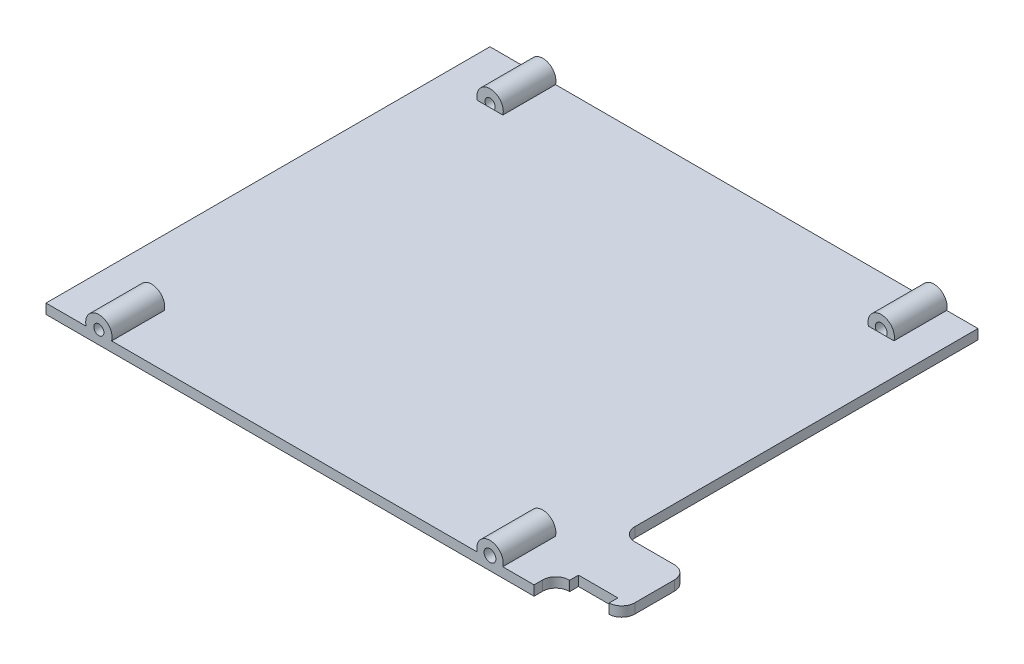
ISO-10303-21;
HEADER;
FILE_DESCRIPTION(('STEP AP214'),'2;1');
FILE_NAME('part.step','',(''),(''),'','','');
FILE_SCHEMA(('AUTOMOTIVE_DESIGN { 1 0 10303 214 1 1 1 1 }'));
ENDSEC;
DATA;
#1=APPLICATION_CONTEXT('core data for automotive mechanical design processes');
#2=APPLICATION_PROTOCOL_DEFINITION('international standard','automotive_design',2000,#1);
#3=PRODUCT_CONTEXT('',#1,'mechanical');
#4=PRODUCT('Part','Part','',(#3));
#5=PRODUCT_RELATED_PRODUCT_CATEGORY('part','',(#4));
#6=PRODUCT_DEFINITION_FORMATION('','',#4);
#7=PRODUCT_DEFINITION_CONTEXT('part definition',#1,'design');
#8=PRODUCT_DEFINITION('design','',#6,#7);
#9=PRODUCT_DEFINITION_SHAPE('','',#8);
#10=(LENGTH_UNIT() NAMED_UNIT(*) SI_UNIT(.MILLI.,.METRE.));
#11=(NAMED_UNIT(*) PLANE_ANGLE_UNIT() SI_UNIT($,.RADIAN.));
#12=(NAMED_UNIT(*) SI_UNIT($,.STERADIAN.) SOLID_ANGLE_UNIT());
#13=UNCERTAINTY_MEASURE_WITH_UNIT(LENGTH_MEASURE(1.E-05),#10,'distance_accuracy_value','');
#14=(GEOMETRIC_REPRESENTATION_CONTEXT(3) GLOBAL_UNCERTAINTY_ASSIGNED_CONTEXT((#13)) GLOBAL_UNIT_ASSIGNED_CONTEXT((#10,
#11,#12)) REPRESENTATION_CONTEXT('',''));
#15=CARTESIAN_POINT('',(0.,0.,0.));
#16=DIRECTION('',(0.,0.,1.));
#17=DIRECTION('',(1.,0.,0.));
#18=AXIS2_PLACEMENT_3D('',#15,#16,#17);
#19=CARTESIAN_POINT('',(-85.5905303741347,-18.8675075749451,141.472563016622));
#20=DIRECTION('',(-1.,0.,0.));
#21=DIRECTION('',(0.,-1.,0.));
#22=AXIS2_PLACEMENT_3D('',#19,#20,#21);
#23=PLANE('',#22);
#24=DIRECTION('',(0.,0.999999944421007,-0.000333403635094687));
#25=VECTOR('',#24,1.);
#26=CARTESIAN_POINT('',(-85.5905303741347,-20.3675075749451,52.0805001054825));
#27=LINE('',#26,#25);
#28=CARTESIAN_POINT('',(-85.5905303741347,-20.3675075749451,52.0805001054825));
#29=VERTEX_POINT('',#28);
#30=CARTESIAN_POINT('',(-85.5905303741347,-18.8675075749451,52.080000000002));
#31=VERTEX_POINT('',#30);
#32=EDGE_CURVE('E249',#29,#31,#27,.T.);
#33=ORIENTED_EDGE('',*,*,#32,.F.);
#34=DIRECTION('',(0.,0.,-1.));
#35=VECTOR('',#34,1.);
#36=CARTESIAN_POINT('',(-85.5905303741347,-20.3675075749451,141.472563016622));
#37=LINE('',#36,#35);
#38=CARTESIAN_POINT('',(-85.5905303741347,-20.3675075749451,0.));
#39=VERTEX_POINT('',#38);
#40=EDGE_CURVE('E398',#29,#39,#37,.T.);
#41=ORIENTED_EDGE('',*,*,#40,.T.);
#42=DIRECTION('',(0.,1.,0.));
#43=VECTOR('',#42,1.);
#44=CARTESIAN_POINT('',(-85.5905303741347,-18.8675075749451,0.));
#45=LINE('',#44,#43);
#46=CARTESIAN_POINT('',(-85.5905303741347,-18.8675075749451,0.));
#47=VERTEX_POINT('',#46);
#48=EDGE_CURVE('E390',#39,#47,#45,.T.);
#49=ORIENTED_EDGE('',*,*,#48,.T.);
#50=DIRECTION('',(0.,0.,-1.));
#51=VECTOR('',#50,1.);
#52=CARTESIAN_POINT('',(-85.5905303741347,-18.8675075749451,141.472563016622));
#53=LINE('',#52,#51);
#54=EDGE_CURVE('E393',#31,#47,#53,.T.);
#55=ORIENTED_EDGE('',*,*,#54,.F.);
#56=EDGE_LOOP('',(#33,#41,#49,#55));
#57=FACE_BOUND('',#56,.T.);
#58=ADVANCED_FACE('F39',(#57),#23,.F.);
#59=CARTESIAN_POINT('',(-159.667908124511,-18.8675075749451,141.472563016622));
#60=DIRECTION('',(0.,-1.,0.));
#61=DIRECTION('',(1.,0.,0.));
#62=AXIS2_PLACEMENT_3D('',#59,#60,#61);
#63=PLANE('',#62);
#64=DIRECTION('',(1.,0.,0.));
#65=VECTOR('',#64,1.);
#66=CARTESIAN_POINT('',(-159.667908124511,-18.8675075749451,62.7311529803631));
#67=LINE('',#66,#65);
#68=CARTESIAN_POINT('',(-83.4954652130825,-18.8675075749451,62.7311529803631));
#69=VERTEX_POINT('',#68);
#70=CARTESIAN_POINT('',(-77.5092926086521,-18.8675075749451,62.7311529803631));
#71=VERTEX_POINT('',#70);
#72=EDGE_CURVE('E224',#69,#71,#67,.T.);
#73=ORIENTED_EDGE('',*,*,#72,.T.);
#74=DIRECTION('',(0.,0.,1.));
#75=VECTOR('',#74,1.);
#76=CARTESIAN_POINT('',(-77.5092926086521,-18.8675075749451,141.472563016622));
#77=LINE('',#76,#75);
#78=CARTESIAN_POINT('',(-77.5092926086521,-18.8675075749449,64.0783494252668));
#79=VERTEX_POINT('',#78);
#80=EDGE_CURVE('E242',#71,#79,#77,.T.);
#81=ORIENTED_EDGE('',*,*,#80,.T.);
#82=CARTESIAN_POINT('',(-77.5905303741347,-18.867507574945,62.0800000000012));
#83=DIRECTION('',(0.,-1.,0.));
#84=DIRECTION('',(1.,0.,0.));
#85=AXIS2_PLACEMENT_3D('',#82,#83,#84);
#86=CIRCLE('',#85,2.);
#87=CARTESIAN_POINT('',(-75.5905303741347,-18.867507574945,62.0800000000012));
#88=VERTEX_POINT('',#87);
#89=EDGE_CURVE('E261',#88,#79,#86,.T.);
#90=ORIENTED_EDGE('',*,*,#89,.F.);
#91=DIRECTION('',(0.,0.,1.));
#92=VECTOR('',#91,1.);
#93=CARTESIAN_POINT('',(-75.5905303741347,-18.867507574945,52.080000000002));
#94=LINE('',#93,#92);
#95=CARTESIAN_POINT('',(-75.5905303741347,-18.867507574945,56.0800000000021));
#96=VERTEX_POINT('',#95);
#97=EDGE_CURVE('E258',#96,#88,#94,.T.);
#98=ORIENTED_EDGE('',*,*,#97,.F.);
#99=CARTESIAN_POINT('',(-77.5905303741347,-18.867507574945,56.0800000000021));
#100=DIRECTION('',(0.,-1.,0.));
#101=DIRECTION('',(1.,0.,0.));
#102=AXIS2_PLACEMENT_3D('',#99,#100,#101);
#103=CIRCLE('',#102,2.);
#104=CARTESIAN_POINT('',(-77.5905303741347,-18.867507574945,54.0800000000021));
#105=VERTEX_POINT('',#104);
#106=EDGE_CURVE('E255',#105,#96,#103,.T.);
#107=ORIENTED_EDGE('',*,*,#106,.F.);
#108=DIRECTION('',(1.,0.,0.));
#109=VECTOR('',#108,1.);
#110=CARTESIAN_POINT('',(-33.1479999999989,-18.8675075749446,54.0800000000021));
#111=LINE('',#110,#109);
#112=CARTESIAN_POINT('',(-83.5905303741347,-18.8675075749451,54.0800000000021));
#113=VERTEX_POINT('',#112);
#114=EDGE_CURVE('E253',#113,#105,#111,.T.);
#115=ORIENTED_EDGE('',*,*,#114,.F.);
#116=CARTESIAN_POINT('',(-83.5905303741347,-18.8675075749451,52.0800000000021));
#117=DIRECTION('',(0.,-1.,0.));
#118=DIRECTION('',(1.,0.,0.));
#119=AXIS2_PLACEMENT_3D('',#116,#117,#118);
#120=CIRCLE('',#119,2.);
#121=EDGE_CURVE('E62',#113,#31,#120,.T.);
#122=ORIENTED_EDGE('',*,*,#121,.T.);
#123=ORIENTED_EDGE('',*,*,#54,.T.);
#124=DIRECTION('',(-1.,0.,0.));
#125=VECTOR('',#124,1.);
#126=CARTESIAN_POINT('',(-159.667908124511,-18.8675075749451,0.));
#127=LINE('',#126,#125);
#128=CARTESIAN_POINT('',(-90.3438704257039,-18.8675075749451,0.));
#129=VERTEX_POINT('',#128);
#130=EDGE_CURVE('E386',#47,#129,#127,.T.);
#131=ORIENTED_EDGE('',*,*,#130,.T.);
#132=DIRECTION('',(0.,0.,-1.));
#133=VECTOR('',#132,1.);
#134=CARTESIAN_POINT('',(-90.3438704257039,-18.8675075749451,8.));
#135=LINE('',#134,#133);
#136=CARTESIAN_POINT('',(-90.3438704257039,-18.8675075749451,8.));
#137=VERTEX_POINT('',#136);
#138=EDGE_CURVE('E360',#137,#129,#135,.T.);
#139=ORIENTED_EDGE('',*,*,#138,.F.);
#140=DIRECTION('',(-1.,0.,0.));
#141=VECTOR('',#140,1.);
#142=CARTESIAN_POINT('',(-159.667908124511,-18.8675075749451,8.00000000000001));
#143=LINE('',#142,#141);
#144=CARTESIAN_POINT('',(-91.5320306214526,-18.8675075749451,8.));
#145=VERTEX_POINT('',#144);
#146=EDGE_CURVE('E420',#137,#145,#143,.T.);
#147=ORIENTED_EDGE('',*,*,#146,.T.);
#148=CARTESIAN_POINT('',(-93.0286935761624,-18.8675075749451,8.));
#149=VERTEX_POINT('',#148);
#150=EDGE_CURVE('E424',#145,#149,#143,.T.);
#151=ORIENTED_EDGE('',*,*,#150,.T.);
#152=CARTESIAN_POINT('',(-94.2168537719112,-18.8675075749451,8.));
#153=VERTEX_POINT('',#152);
#154=EDGE_CURVE('E402',#149,#153,#143,.T.);
#155=ORIENTED_EDGE('',*,*,#154,.T.);
#156=DIRECTION('',(0.,0.,-1.));
#157=VECTOR('',#156,1.);
#158=CARTESIAN_POINT('',(-94.2168537719112,-18.8675075749451,8.));
#159=LINE('',#158,#157);
#160=CARTESIAN_POINT('',(-94.2168537719112,-18.8675075749451,0.));
#161=VERTEX_POINT('',#160);
#162=EDGE_CURVE('E371',#161,#153,#159,.F.);
#163=ORIENTED_EDGE('',*,*,#162,.F.);
#164=CARTESIAN_POINT('',(-149.708016259504,-18.8675075749451,0.));
#165=VERTEX_POINT('',#164);
#166=EDGE_CURVE('E388',#161,#165,#127,.T.);
#167=ORIENTED_EDGE('',*,*,#166,.T.);
#168=DIRECTION('',(0.,0.,-1.));
#169=VECTOR('',#168,1.);
#170=CARTESIAN_POINT('',(-149.708016259504,-18.8675075749451,8.));
#171=LINE('',#170,#169);
#172=CARTESIAN_POINT('',(-149.708016259504,-18.8675075749451,8.));
#173=VERTEX_POINT('',#172);
#174=EDGE_CURVE('E374',#173,#165,#171,.T.);
#175=ORIENTED_EDGE('',*,*,#174,.F.);
#176=DIRECTION('',(-1.,0.,0.));
#177=VECTOR('',#176,1.);
#178=CARTESIAN_POINT('',(-159.667908124511,-18.8675075749451,8.00000000000001));
#179=LINE('',#178,#177);
#180=CARTESIAN_POINT('',(-151.059398233736,-18.8675075749451,8.));
#181=VERTEX_POINT('',#180);
#182=EDGE_CURVE('E425',#173,#181,#179,.T.);
#183=ORIENTED_EDGE('',*,*,#182,.T.);
#184=CARTESIAN_POINT('',(-152.22961763148,-18.8675075749451,8.));
#185=VERTEX_POINT('',#184);
#186=EDGE_CURVE('E429',#181,#185,#179,.T.);
#187=ORIENTED_EDGE('',*,*,#186,.T.);
#188=CARTESIAN_POINT('',(-153.580999605712,-18.8675075749451,8.));
#189=VERTEX_POINT('',#188);
#190=EDGE_CURVE('E423',#185,#189,#179,.T.);
#191=ORIENTED_EDGE('',*,*,#190,.T.);
#192=DIRECTION('',(0.,0.,-1.));
#193=VECTOR('',#192,1.);
#194=CARTESIAN_POINT('',(-153.580999605712,-18.8675075749451,8.));
#195=LINE('',#194,#193);
#196=CARTESIAN_POINT('',(-153.580999605712,-18.8675075749451,0.));
#197=VERTEX_POINT('',#196);
#198=EDGE_CURVE('E377',#197,#189,#195,.F.);
#199=ORIENTED_EDGE('',*,*,#198,.F.);
#200=CARTESIAN_POINT('',(-159.667908124511,-18.8675075749451,0.));
#201=VERTEX_POINT('',#200);
#202=EDGE_CURVE('E389',#197,#201,#127,.T.);
#203=ORIENTED_EDGE('',*,*,#202,.T.);
#204=DIRECTION('',(0.,0.,-1.));
#205=VECTOR('',#204,1.);
#206=CARTESIAN_POINT('',(-159.667908124511,-18.8675075749451,141.472563016622));
#207=LINE('',#206,#205);
#208=CARTESIAN_POINT('',(-159.667908124511,-18.8675075749451,67.3800000000011));
#209=VERTEX_POINT('',#208);
#210=EDGE_CURVE('E385',#209,#201,#207,.T.);
#211=ORIENTED_EDGE('',*,*,#210,.F.);
#212=DIRECTION('',(-1.,0.,0.));
#213=VECTOR('',#212,1.);
#214=CARTESIAN_POINT('',(-159.667908124511,-18.8675075749451,67.3800000000011));
#215=LINE('',#214,#213);
#216=CARTESIAN_POINT('',(-153.580999605713,-18.8675075749451,67.3800000000011));
#217=VERTEX_POINT('',#216);
#218=EDGE_CURVE('E404',#217,#209,#215,.T.);
#219=ORIENTED_EDGE('',*,*,#218,.F.);
#220=DIRECTION('',(0.,0.,1.));
#221=VECTOR('',#220,1.);
#222=CARTESIAN_POINT('',(-153.580999605713,-18.8675075749451,59.3800000000013));
#223=LINE('',#222,#221);
#224=CARTESIAN_POINT('',(-153.580999605713,-18.8675075749451,59.3800000000013));
#225=VERTEX_POINT('',#224);
#226=EDGE_CURVE('E328',#225,#217,#223,.T.);
#227=ORIENTED_EDGE('',*,*,#226,.F.);
#228=DIRECTION('',(1.,0.,0.));
#229=VECTOR('',#228,1.);
#230=CARTESIAN_POINT('',(-159.667908124511,-18.8675075749451,59.3800000000013));
#231=LINE('',#230,#229);
#232=CARTESIAN_POINT('',(-152.22961763148,-18.8675075749451,59.3800000000013));
#233=VERTEX_POINT('',#232);
#234=EDGE_CURVE('E340',#225,#233,#231,.T.);
#235=ORIENTED_EDGE('',*,*,#234,.T.);
#236=CARTESIAN_POINT('',(-151.059398233736,-18.8675075749451,59.3800000000013));
#237=VERTEX_POINT('',#236);
#238=EDGE_CURVE('E344',#233,#237,#231,.T.);
#239=ORIENTED_EDGE('',*,*,#238,.T.);
#240=CARTESIAN_POINT('',(-149.708016259504,-18.8675075749451,59.3800000000013));
#241=VERTEX_POINT('',#240);
#242=EDGE_CURVE('E338',#237,#241,#231,.T.);
#243=ORIENTED_EDGE('',*,*,#242,.T.);
#244=DIRECTION('',(0.,0.,1.));
#245=VECTOR('',#244,1.);
#246=CARTESIAN_POINT('',(-149.708016259504,-18.8675075749451,59.3800000000013));
#247=LINE('',#246,#245);
#248=CARTESIAN_POINT('',(-149.708016259504,-18.8675075749451,67.3800000000013));
#249=VERTEX_POINT('',#248);
#250=EDGE_CURVE('E331',#249,#241,#247,.F.);
#251=ORIENTED_EDGE('',*,*,#250,.F.);
#252=CARTESIAN_POINT('',(-94.216853771912,-18.8675075749451,67.3800000000012));
#253=VERTEX_POINT('',#252);
#254=EDGE_CURVE('E403',#253,#249,#215,.T.);
#255=ORIENTED_EDGE('',*,*,#254,.F.);
#256=DIRECTION('',(0.,0.,1.));
#257=VECTOR('',#256,1.);
#258=CARTESIAN_POINT('',(-94.216853771912,-18.8675075749451,59.3800000000013));
#259=LINE('',#258,#257);
#260=CARTESIAN_POINT('',(-94.216853771912,-18.8675075749451,59.3800000000013));
#261=VERTEX_POINT('',#260);
#262=EDGE_CURVE('E316',#261,#253,#259,.T.);
#263=ORIENTED_EDGE('',*,*,#262,.F.);
#264=DIRECTION('',(1.,0.,0.));
#265=VECTOR('',#264,1.);
#266=CARTESIAN_POINT('',(-159.667908124511,-18.8675075749451,59.3800000000013));
#267=LINE('',#266,#265);
#268=CARTESIAN_POINT('',(-93.028693576163,-18.8675075749451,59.3800000000013));
#269=VERTEX_POINT('',#268);
#270=EDGE_CURVE('E335',#261,#269,#267,.T.);
#271=ORIENTED_EDGE('',*,*,#270,.T.);
#272=CARTESIAN_POINT('',(-91.5320306214525,-18.8675075749451,59.3800000000013));
#273=VERTEX_POINT('',#272);
#274=EDGE_CURVE('E339',#269,#273,#267,.T.);
#275=ORIENTED_EDGE('',*,*,#274,.T.);
#276=CARTESIAN_POINT('',(-90.343870425704,-18.8675075749451,59.3800000000013));
#277=VERTEX_POINT('',#276);
#278=EDGE_CURVE('E334',#273,#277,#267,.T.);
#279=ORIENTED_EDGE('',*,*,#278,.T.);
#280=DIRECTION('',(0.,0.,1.));
#281=VECTOR('',#280,1.);
#282=CARTESIAN_POINT('',(-90.343870425704,-18.8675075749451,59.3800000000013));
#283=LINE('',#282,#281);
#284=CARTESIAN_POINT('',(-90.343870425704,-18.8675075749451,67.3800000000013));
#285=VERTEX_POINT('',#284);
#286=EDGE_CURVE('E325',#285,#277,#283,.F.);
#287=ORIENTED_EDGE('',*,*,#286,.F.);
#288=CARTESIAN_POINT('',(-85.5905303741347,-18.8675075749451,67.3800000000012));
#289=VERTEX_POINT('',#288);
#290=EDGE_CURVE('E399',#289,#285,#215,.T.);
#291=ORIENTED_EDGE('',*,*,#290,.F.);
#292=CARTESIAN_POINT('',(-85.5905303741347,-18.8675075749451,66.0800000000012));
#293=VERTEX_POINT('',#292);
#294=EDGE_CURVE('E414',#289,#293,#53,.T.);
#295=ORIENTED_EDGE('',*,*,#294,.T.);
#296=CARTESIAN_POINT('',(-83.5905303741347,-18.8675075749451,66.0800000000012));
#297=DIRECTION('',(0.,-1.,0.));
#298=DIRECTION('',(1.,0.,0.));
#299=AXIS2_PLACEMENT_3D('',#296,#297,#298);
#300=CIRCLE('',#299,2.);
#301=CARTESIAN_POINT('',(-83.5905303741347,-18.8675075749451,64.0800000000012));
#302=VERTEX_POINT('',#301);
#303=EDGE_CURVE('E270',#293,#302,#300,.T.);
#304=ORIENTED_EDGE('',*,*,#303,.T.);
#305=DIRECTION('',(-1.,0.,0.));
#306=VECTOR('',#305,1.);
#307=CARTESIAN_POINT('',(-33.147999999999,-18.8675075749446,64.0800000000013));
#308=LINE('',#307,#306);
#309=CARTESIAN_POINT('',(-83.4954652130825,-18.8675075749449,64.0800000000012));
#310=VERTEX_POINT('',#309);
#311=EDGE_CURVE('E264',#310,#302,#308,.T.);
#312=ORIENTED_EDGE('',*,*,#311,.F.);
#313=DIRECTION('',(0.,0.,-1.));
#314=VECTOR('',#313,1.);
#315=CARTESIAN_POINT('',(-83.4954652130825,-18.8675075749451,141.472563016622));
#316=LINE('',#315,#314);
#317=EDGE_CURVE('E246',#310,#69,#316,.T.);
#318=ORIENTED_EDGE('',*,*,#317,.T.);
#319=EDGE_LOOP('',(#73,#81,#90,#98,#107,#115,#122,#123,#131,#139,#147,#151,#155,#163,#167,#175,
#183,#187,#191,#199,#203,#211,#219,#227,#235,#239,#243,#251,#255,#263,#271,#275,#279,#287,#291,
#295,#304,#312,#318));
#320=FACE_BOUND('',#319,.T.);
#321=ADVANCED_FACE('F438',(#320),#63,.F.);
#322=CARTESIAN_POINT('',(-85.5905303741347,-20.3675075749451,141.472563016622));
#323=DIRECTION('',(0.,1.,0.));
#324=DIRECTION('',(-1.,0.,0.));
#325=AXIS2_PLACEMENT_3D('',#322,#323,#324);
#326=PLANE('',#325);
#327=CARTESIAN_POINT('',(-77.5905303741347,-20.3675075749451,62.0800000000012));
#328=DIRECTION('',(0.,1.,0.));
#329=DIRECTION('',(-1.,0.,0.));
#330=AXIS2_PLACEMENT_3D('',#327,#328,#329);
#331=CIRCLE('',#330,2.);
#332=CARTESIAN_POINT('',(-77.5092926086521,-20.3675075749451,64.0783494252668));
#333=VERTEX_POINT('',#332);
#334=CARTESIAN_POINT('',(-75.5905303741347,-20.3675075749451,62.0800000000012));
#335=VERTEX_POINT('',#334);
#336=EDGE_CURVE('E277',#333,#335,#331,.T.);
#337=ORIENTED_EDGE('',*,*,#336,.F.);
#338=DIRECTION('',(0.,0.,1.));
#339=VECTOR('',#338,1.);
#340=CARTESIAN_POINT('',(-77.5092926086521,-20.3675075749454,62.7311529803631));
#341=LINE('',#340,#339);
#342=CARTESIAN_POINT('',(-77.5092926086521,-20.3675075749454,62.7311529803631));
#343=VERTEX_POINT('',#342);
#344=EDGE_CURVE('E54',#343,#333,#341,.T.);
#345=ORIENTED_EDGE('',*,*,#344,.F.);
#346=DIRECTION('',(1.,0.,0.));
#347=VECTOR('',#346,1.);
#348=CARTESIAN_POINT('',(-83.4954652130825,-20.3675075749454,62.7311529803631));
#349=LINE('',#348,#347);
#350=CARTESIAN_POINT('',(-83.4954652130825,-20.3675075749454,62.7311529803631));
#351=VERTEX_POINT('',#350);
#352=EDGE_CURVE('E222',#351,#343,#349,.T.);
#353=ORIENTED_EDGE('',*,*,#352,.F.);
#354=DIRECTION('',(0.,0.,-1.));
#355=VECTOR('',#354,1.);
#356=CARTESIAN_POINT('',(-83.4954652130825,-20.3675075749454,66.6522392252637));
#357=LINE('',#356,#355);
#358=CARTESIAN_POINT('',(-83.4954652130825,-20.3675075749454,64.0800000000012));
#359=VERTEX_POINT('',#358);
#360=EDGE_CURVE('E230',#359,#351,#357,.T.);
#361=ORIENTED_EDGE('',*,*,#360,.F.);
#362=DIRECTION('',(1.,0.,0.));
#363=VECTOR('',#362,1.);
#364=CARTESIAN_POINT('',(-85.5905303741347,-20.3675075749451,64.080000000002));
#365=LINE('',#364,#363);
#366=CARTESIAN_POINT('',(-83.5905303741347,-20.3675075749451,64.080000000002));
#367=VERTEX_POINT('',#366);
#368=EDGE_CURVE('E275',#367,#359,#365,.T.);
#369=ORIENTED_EDGE('',*,*,#368,.F.);
#370=CARTESIAN_POINT('',(-83.5905303741347,-20.3675075749451,66.0800000000012));
#371=DIRECTION('',(0.,1.,0.));
#372=DIRECTION('',(-1.,0.,0.));
#373=AXIS2_PLACEMENT_3D('',#370,#371,#372);
#374=CIRCLE('',#373,2.);
#375=CARTESIAN_POINT('',(-85.5905303741347,-20.3675075749451,66.0800000000012));
#376=VERTEX_POINT('',#375);
#377=EDGE_CURVE('E273',#376,#367,#374,.F.);
#378=ORIENTED_EDGE('',*,*,#377,.F.);
#379=CARTESIAN_POINT('',(-85.5905303741347,-20.3675075749451,67.3800000000012));
#380=VERTEX_POINT('',#379);
#381=EDGE_CURVE('E394',#380,#376,#37,.T.);
#382=ORIENTED_EDGE('',*,*,#381,.F.);
#383=DIRECTION('',(1.,0.,0.));
#384=VECTOR('',#383,1.);
#385=CARTESIAN_POINT('',(-85.5905303741346,-20.3675075749451,67.3800000000012));
#386=LINE('',#385,#384);
#387=CARTESIAN_POINT('',(-159.667908124511,-20.3675075749451,67.3800000000011));
#388=VERTEX_POINT('',#387);
#389=EDGE_CURVE('E408',#388,#380,#386,.T.);
#390=ORIENTED_EDGE('',*,*,#389,.F.);
#391=DIRECTION('',(0.,0.,-1.));
#392=VECTOR('',#391,1.);
#393=CARTESIAN_POINT('',(-159.667908124511,-20.3675075749451,141.472563016622));
#394=LINE('',#393,#392);
#395=CARTESIAN_POINT('',(-159.667908124511,-20.3675075749451,0.));
#396=VERTEX_POINT('',#395);
#397=EDGE_CURVE('E380',#388,#396,#394,.T.);
#398=ORIENTED_EDGE('',*,*,#397,.T.);
#399=DIRECTION('',(1.,0.,0.));
#400=VECTOR('',#399,1.);
#401=CARTESIAN_POINT('',(-85.5905303741347,-20.3675075749451,0.));
#402=LINE('',#401,#400);
#403=EDGE_CURVE('E395',#396,#39,#402,.T.);
#404=ORIENTED_EDGE('',*,*,#403,.T.);
#405=ORIENTED_EDGE('',*,*,#40,.F.);
#406=CARTESIAN_POINT('',(-83.5905303741347,-20.3675075749451,52.0800000000021));
#407=DIRECTION('',(0.,1.,0.));
#408=DIRECTION('',(-1.,0.,0.));
#409=AXIS2_PLACEMENT_3D('',#406,#407,#408);
#410=CIRCLE('',#409,2.);
#411=CARTESIAN_POINT('',(-83.5905303741347,-20.3675075749451,54.0800000000021));
#412=VERTEX_POINT('',#411);
#413=EDGE_CURVE('E267',#29,#412,#410,.T.);
#414=ORIENTED_EDGE('',*,*,#413,.T.);
#415=DIRECTION('',(-1.,0.,0.));
#416=VECTOR('',#415,1.);
#417=CARTESIAN_POINT('',(-75.5905303741347,-20.3675075749451,54.0800000000021));
#418=LINE('',#417,#416);
#419=CARTESIAN_POINT('',(-77.5905303741347,-20.3675075749451,54.0800000000021));
#420=VERTEX_POINT('',#419);
#421=EDGE_CURVE('E269',#420,#412,#418,.T.);
#422=ORIENTED_EDGE('',*,*,#421,.F.);
#423=CARTESIAN_POINT('',(-77.5905303741347,-20.3675075749451,56.0800000000021));
#424=DIRECTION('',(0.,1.,0.));
#425=DIRECTION('',(-1.,0.,0.));
#426=AXIS2_PLACEMENT_3D('',#423,#424,#425);
#427=CIRCLE('',#426,2.);
#428=CARTESIAN_POINT('',(-75.5905303741347,-20.3675075749451,56.0800000000021));
#429=VERTEX_POINT('',#428);
#430=EDGE_CURVE('E266',#429,#420,#427,.T.);
#431=ORIENTED_EDGE('',*,*,#430,.F.);
#432=DIRECTION('',(0.,0.,-1.));
#433=VECTOR('',#432,1.);
#434=CARTESIAN_POINT('',(-75.5905303741347,-20.3675075749451,64.0800000000021));
#435=LINE('',#434,#433);
#436=EDGE_CURVE('E279',#335,#429,#435,.T.);
#437=ORIENTED_EDGE('',*,*,#436,.F.);
#438=EDGE_LOOP('',(#337,#345,#353,#361,#369,#378,#382,#390,#398,#404,#405,#414,#422,#431,#437));
#439=FACE_BOUND('',#438,.T.);
#440=ADVANCED_FACE('F238',(#439),#326,.F.);
#441=ORIENTED_EDGE('',*,*,#381,.T.);
#442=DIRECTION('',(0.,1.,0.));
#443=VECTOR('',#442,1.);
#444=CARTESIAN_POINT('',(-85.5905303741347,19.6324924250549,66.0800000000012));
#445=LINE('',#444,#443);
#446=EDGE_CURVE('E252',#293,#376,#445,.F.);
#447=ORIENTED_EDGE('',*,*,#446,.F.);
#448=ORIENTED_EDGE('',*,*,#294,.F.);
#449=DIRECTION('',(0.,1.,0.));
#450=VECTOR('',#449,1.);
#451=CARTESIAN_POINT('',(-85.5905303741347,-18.8675075749451,67.3800000000012));
#452=LINE('',#451,#450);
#453=EDGE_CURVE('E405',#380,#289,#452,.T.);
#454=ORIENTED_EDGE('',*,*,#453,.F.);
#455=EDGE_LOOP('',(#441,#447,#448,#454));
#456=FACE_BOUND('',#455,.T.);
#457=ADVANCED_FACE('F497',(#456),#23,.F.);
#458=CARTESIAN_POINT('',(-159.667908124511,-20.3675075749451,141.472563016622));
#459=DIRECTION('',(1.,0.,0.));
#460=DIRECTION('',(0.,0.,-1.));
#461=AXIS2_PLACEMENT_3D('',#458,#459,#460);
#462=PLANE('',#461);
#463=DIRECTION('',(0.,-1.,0.));
#464=VECTOR('',#463,1.);
#465=CARTESIAN_POINT('',(-159.667908124511,-20.3675075749451,67.3800000000011));
#466=LINE('',#465,#464);
#467=EDGE_CURVE('E384',#209,#388,#466,.T.);
#468=ORIENTED_EDGE('',*,*,#467,.F.);
#469=ORIENTED_EDGE('',*,*,#210,.T.);
#470=DIRECTION('',(0.,-1.,0.));
#471=VECTOR('',#470,1.);
#472=CARTESIAN_POINT('',(-159.667908124511,-20.3675075749451,0.));
#473=LINE('',#472,#471);
#474=EDGE_CURVE('E381',#201,#396,#473,.T.);
#475=ORIENTED_EDGE('',*,*,#474,.T.);
#476=ORIENTED_EDGE('',*,*,#397,.F.);
#477=EDGE_LOOP('',(#468,#469,#475,#476));
#478=FACE_BOUND('',#477,.T.);
#479=ADVANCED_FACE('F504',(#478),#462,.F.);
#480=CARTESIAN_POINT('',(0.,0.,0.));
#481=DIRECTION('',(0.,0.,-1.));
#482=DIRECTION('',(-1.,0.,0.));
#483=AXIS2_PLACEMENT_3D('',#480,#481,#482);
#484=PLANE('',#483);
#485=CARTESIAN_POINT('',(-151.644507932608,-18.3675075749456,0.));
#486=DIRECTION('',(0.,0.,-1.));
#487=DIRECTION('',(-1.,0.,0.));
#488=AXIS2_PLACEMENT_3D('',#485,#486,#487);
#489=CIRCLE('',#488,0.769644956920995);
#490=CARTESIAN_POINT('',(-152.414152889529,-18.3675075749456,0.));
#491=VERTEX_POINT('',#490);
#492=EDGE_CURVE('E345',#491,#491,#489,.T.);
#493=ORIENTED_EDGE('',*,*,#492,.F.);
#494=EDGE_LOOP('',(#493));
#495=FACE_BOUND('',#494,.T.);
#496=CARTESIAN_POINT('',(-92.2803620988075,-18.3675075749452,0.));
#497=DIRECTION('',(0.,0.,-1.));
#498=DIRECTION('',(-1.,0.,0.));
#499=AXIS2_PLACEMENT_3D('',#496,#497,#498);
#500=CIRCLE('',#499,0.900000000000003);
#501=CARTESIAN_POINT('',(-93.1803620988075,-18.3675075749452,0.));
#502=VERTEX_POINT('',#501);
#503=EDGE_CURVE('E349',#502,#502,#500,.T.);
#504=ORIENTED_EDGE('',*,*,#503,.F.);
#505=EDGE_LOOP('',(#504));
#506=FACE_BOUND('',#505,.T.);
#507=ORIENTED_EDGE('',*,*,#48,.F.);
#508=ORIENTED_EDGE('',*,*,#403,.F.);
#509=ORIENTED_EDGE('',*,*,#474,.F.);
#510=ORIENTED_EDGE('',*,*,#202,.F.);
#511=CARTESIAN_POINT('',(-151.644507932608,-18.3675075749453,0.));
#512=DIRECTION('',(0.,0.,1.));
#513=DIRECTION('',(1.,0.,0.));
#514=AXIS2_PLACEMENT_3D('',#511,#512,#513);
#515=CIRCLE('',#514,2.00000000000008);
#516=EDGE_CURVE('E361',#165,#197,#515,.T.);
#517=ORIENTED_EDGE('',*,*,#516,.F.);
#518=ORIENTED_EDGE('',*,*,#166,.F.);
#519=CARTESIAN_POINT('',(-92.2803620988075,-18.3675075749452,0.));
#520=DIRECTION('',(0.,0.,1.));
#521=DIRECTION('',(1.,0.,0.));
#522=AXIS2_PLACEMENT_3D('',#519,#520,#521);
#523=CIRCLE('',#522,1.99999999999992);
#524=EDGE_CURVE('E364',#129,#161,#523,.T.);
#525=ORIENTED_EDGE('',*,*,#524,.F.);
#526=ORIENTED_EDGE('',*,*,#130,.F.);
#527=EDGE_LOOP('',(#507,#508,#509,#510,#517,#518,#525,#526));
#528=FACE_BOUND('',#527,.T.);
#529=ADVANCED_FACE('F467',(#495,#506,#528),#484,.T.);
#530=CARTESIAN_POINT('',(-53.15,-0.367507574945569,67.3800000000013));
#531=DIRECTION('',(0.,0.,1.));
#532=DIRECTION('',(0.999885624174656,-0.0151241055556286,0.));
#533=AXIS2_PLACEMENT_3D('',#530,#531,#532);
#534=PLANE('',#533);
#535=CARTESIAN_POINT('',(-92.2803620988078,-18.3675075749455,67.3800000000013));
#536=DIRECTION('',(0.,0.,-1.));
#537=DIRECTION('',(0.,1.,0.));
#538=AXIS2_PLACEMENT_3D('',#535,#536,#537);
#539=CIRCLE('',#538,0.900000000000158);
#540=CARTESIAN_POINT('',(-92.2803620988078,-17.4675075749454,67.3800000000013));
#541=VERTEX_POINT('',#540);
#542=EDGE_CURVE('E303',#541,#541,#539,.T.);
#543=ORIENTED_EDGE('',*,*,#542,.T.);
#544=EDGE_LOOP('',(#543));
#545=FACE_BOUND('',#544,.T.);
#546=CARTESIAN_POINT('',(-151.644507932608,-18.3675075749455,67.3800000000013));
#547=DIRECTION('',(0.,0.,-1.));
#548=DIRECTION('',(0.,1.,0.));
#549=AXIS2_PLACEMENT_3D('',#546,#547,#548);
#550=CIRCLE('',#549,0.769644956920995);
#551=CARTESIAN_POINT('',(-151.644507932608,-17.5978626180245,67.3800000000013));
#552=VERTEX_POINT('',#551);
#553=EDGE_CURVE('E286',#552,#552,#550,.T.);
#554=ORIENTED_EDGE('',*,*,#553,.T.);
#555=EDGE_LOOP('',(#554));
#556=FACE_BOUND('',#555,.T.);
#557=ORIENTED_EDGE('',*,*,#389,.T.);
#558=ORIENTED_EDGE('',*,*,#453,.T.);
#559=ORIENTED_EDGE('',*,*,#290,.T.);
#560=CARTESIAN_POINT('',(-92.280362098808,-18.3675075749455,67.3800000000013));
#561=DIRECTION('',(0.,0.,-1.));
#562=DIRECTION('',(0.,1.,0.));
#563=AXIS2_PLACEMENT_3D('',#560,#561,#562);
#564=CIRCLE('',#563,2.00000000000021);
#565=EDGE_CURVE('E319',#253,#285,#564,.T.);
#566=ORIENTED_EDGE('',*,*,#565,.F.);
#567=ORIENTED_EDGE('',*,*,#254,.T.);
#568=CARTESIAN_POINT('',(-151.644507932608,-18.3675075749456,67.3800000000013));
#569=DIRECTION('',(0.,0.,-1.));
#570=DIRECTION('',(0.,1.,0.));
#571=AXIS2_PLACEMENT_3D('',#568,#569,#570);
#572=CIRCLE('',#571,2.00000000000039);
#573=EDGE_CURVE('E317',#217,#249,#572,.T.);
#574=ORIENTED_EDGE('',*,*,#573,.F.);
#575=ORIENTED_EDGE('',*,*,#218,.T.);
#576=ORIENTED_EDGE('',*,*,#467,.T.);
#577=EDGE_LOOP('',(#557,#558,#559,#566,#567,#574,#575,#576));
#578=FACE_BOUND('',#577,.T.);
#579=ADVANCED_FACE('F41',(#545,#556,#578),#534,.T.);
#580=CARTESIAN_POINT('',(-92.2803620988075,-18.3675075749452,8.));
#581=DIRECTION('',(0.,0.,1.));
#582=DIRECTION('',(1.,0.,0.));
#583=AXIS2_PLACEMENT_3D('',#580,#581,#582);
#584=PLANE('',#583);
#585=CARTESIAN_POINT('',(-92.2803620988075,-18.3675075749452,8.));
#586=DIRECTION('',(0.,0.,1.));
#587=DIRECTION('',(1.,0.,0.));
#588=AXIS2_PLACEMENT_3D('',#585,#586,#587);
#589=CIRCLE('',#588,0.900000000000003);
#590=EDGE_CURVE('E431',#145,#149,#589,.T.);
#591=ORIENTED_EDGE('',*,*,#590,.F.);
#592=ORIENTED_EDGE('',*,*,#146,.F.);
#593=CARTESIAN_POINT('',(-92.2803620988075,-18.3675075749452,8.));
#594=DIRECTION('',(0.,0.,1.));
#595=DIRECTION('',(1.,0.,0.));
#596=AXIS2_PLACEMENT_3D('',#593,#594,#595);
#597=CIRCLE('',#596,1.99999999999992);
#598=EDGE_CURVE('E352',#137,#153,#597,.T.);
#599=ORIENTED_EDGE('',*,*,#598,.T.);
#600=ORIENTED_EDGE('',*,*,#154,.F.);
#601=EDGE_LOOP('',(#591,#592,#599,#600));
#602=FACE_BOUND('',#601,.T.);
#603=ADVANCED_FACE('F474',(#602),#584,.T.);
#604=CARTESIAN_POINT('',(-92.2803620988075,-18.3675075749452,8.));
#605=DIRECTION('',(0.,0.,-1.));
#606=DIRECTION('',(-1.,0.,0.));
#607=AXIS2_PLACEMENT_3D('',#604,#605,#606);
#608=CYLINDRICAL_SURFACE('',#607,1.99999999999992);
#609=ORIENTED_EDGE('',*,*,#524,.T.);
#610=ORIENTED_EDGE('',*,*,#162,.T.);
#611=ORIENTED_EDGE('',*,*,#598,.F.);
#612=ORIENTED_EDGE('',*,*,#138,.T.);
#613=EDGE_LOOP('',(#609,#610,#611,#612));
#614=FACE_BOUND('',#613,.T.);
#615=ADVANCED_FACE('F466',(#614),#608,.T.);
#616=CARTESIAN_POINT('',(-151.644507932608,-18.3675075749453,8.));
#617=DIRECTION('',(0.,0.,1.));
#618=DIRECTION('',(1.,0.,0.));
#619=AXIS2_PLACEMENT_3D('',#616,#617,#618);
#620=PLANE('',#619);
#621=CARTESIAN_POINT('',(-151.644507932608,-18.3675075749456,8.));
#622=DIRECTION('',(0.,0.,1.));
#623=DIRECTION('',(1.,0.,0.));
#624=AXIS2_PLACEMENT_3D('',#621,#622,#623);
#625=CIRCLE('',#624,0.769644956920995);
#626=EDGE_CURVE('E428',#181,#185,#625,.T.);
#627=ORIENTED_EDGE('',*,*,#626,.F.);
#628=ORIENTED_EDGE('',*,*,#182,.F.);
#629=CARTESIAN_POINT('',(-151.644507932608,-18.3675075749453,8.));
#630=DIRECTION('',(0.,0.,1.));
#631=DIRECTION('',(1.,0.,0.));
#632=AXIS2_PLACEMENT_3D('',#629,#630,#631);
#633=CIRCLE('',#632,2.00000000000008);
#634=EDGE_CURVE('E357',#173,#189,#633,.T.);
#635=ORIENTED_EDGE('',*,*,#634,.T.);
#636=ORIENTED_EDGE('',*,*,#190,.F.);
#637=EDGE_LOOP('',(#627,#628,#635,#636));
#638=FACE_BOUND('',#637,.T.);
#639=ADVANCED_FACE('F538',(#638),#620,.T.);
#640=CARTESIAN_POINT('',(-151.644507932608,-18.3675075749453,8.));
#641=DIRECTION('',(0.,0.,-1.));
#642=DIRECTION('',(-1.,0.,0.));
#643=AXIS2_PLACEMENT_3D('',#640,#641,#642);
#644=CYLINDRICAL_SURFACE('',#643,2.00000000000008);
#645=ORIENTED_EDGE('',*,*,#516,.T.);
#646=ORIENTED_EDGE('',*,*,#198,.T.);
#647=ORIENTED_EDGE('',*,*,#634,.F.);
#648=ORIENTED_EDGE('',*,*,#174,.T.);
#649=EDGE_LOOP('',(#645,#646,#647,#648));
#650=FACE_BOUND('',#649,.T.);
#651=ADVANCED_FACE('F534',(#650),#644,.T.);
#652=CARTESIAN_POINT('',(-92.2803620988075,-18.3675075749452,8.));
#653=DIRECTION('',(0.,0.,1.));
#654=DIRECTION('',(1.,0.,0.));
#655=AXIS2_PLACEMENT_3D('',#652,#653,#654);
#656=PLANE('',#655);
#657=CARTESIAN_POINT('',(-151.644507932608,-18.3675075749456,8.));
#658=DIRECTION('',(0.,0.,1.));
#659=DIRECTION('',(1.,0.,0.));
#660=AXIS2_PLACEMENT_3D('',#657,#658,#659);
#661=CIRCLE('',#660,0.769644956920995);
#662=EDGE_CURVE('E348',#181,#185,#661,.F.);
#663=ORIENTED_EDGE('',*,*,#662,.T.);
#664=ORIENTED_EDGE('',*,*,#186,.F.);
#665=EDGE_LOOP('',(#663,#664));
#666=FACE_BOUND('',#665,.T.);
#667=ADVANCED_FACE('F542',(#666),#656,.F.);
#668=CARTESIAN_POINT('',(-151.644507932608,-18.3675075749456,10.5455844122716));
#669=DIRECTION('',(0.,0.,-1.));
#670=DIRECTION('',(-1.,0.,0.));
#671=AXIS2_PLACEMENT_3D('',#668,#669,#670);
#672=CYLINDRICAL_SURFACE('',#671,0.769644956920995);
#673=ORIENTED_EDGE('',*,*,#492,.T.);
#674=EDGE_LOOP('',(#673));
#675=FACE_BOUND('',#674,.T.);
#676=ORIENTED_EDGE('',*,*,#662,.F.);
#677=ORIENTED_EDGE('',*,*,#626,.T.);
#678=EDGE_LOOP('',(#676,#677));
#679=FACE_BOUND('',#678,.T.);
#680=ADVANCED_FACE('F492',(#675,#679),#672,.F.);
#681=CARTESIAN_POINT('',(-92.2803620988075,-18.3675075749452,8.));
#682=DIRECTION('',(0.,0.,1.));
#683=DIRECTION('',(1.,0.,0.));
#684=AXIS2_PLACEMENT_3D('',#681,#682,#683);
#685=PLANE('',#684);
#686=CARTESIAN_POINT('',(-92.2803620988075,-18.3675075749452,8.));
#687=DIRECTION('',(0.,0.,1.));
#688=DIRECTION('',(1.,0.,0.));
#689=AXIS2_PLACEMENT_3D('',#686,#687,#688);
#690=CIRCLE('',#689,0.900000000000003);
#691=EDGE_CURVE('E343',#145,#149,#690,.F.);
#692=ORIENTED_EDGE('',*,*,#691,.T.);
#693=ORIENTED_EDGE('',*,*,#150,.F.);
#694=EDGE_LOOP('',(#692,#693));
#695=FACE_BOUND('',#694,.T.);
#696=ADVANCED_FACE('F477',(#695),#685,.F.);
#697=CARTESIAN_POINT('',(-92.2803620988075,-18.3675075749452,10.5455844122716));
#698=DIRECTION('',(0.,0.,-1.));
#699=DIRECTION('',(-1.,0.,0.));
#700=AXIS2_PLACEMENT_3D('',#697,#698,#699);
#701=CYLINDRICAL_SURFACE('',#700,0.900000000000003);
#702=ORIENTED_EDGE('',*,*,#503,.T.);
#703=EDGE_LOOP('',(#702));
#704=FACE_BOUND('',#703,.T.);
#705=ORIENTED_EDGE('',*,*,#691,.F.);
#706=ORIENTED_EDGE('',*,*,#590,.T.);
#707=EDGE_LOOP('',(#705,#706));
#708=FACE_BOUND('',#707,.T.);
#709=ADVANCED_FACE('F479',(#704,#708),#701,.F.);
#710=CARTESIAN_POINT('',(-92.280362098808,-18.3675075749456,59.3800000000013));
#711=DIRECTION('',(0.,0.,-1.));
#712=DIRECTION('',(0.,1.,0.));
#713=AXIS2_PLACEMENT_3D('',#710,#711,#712);
#714=PLANE('',#713);
#715=CARTESIAN_POINT('',(-92.2803620988078,-18.3675075749455,59.3800000000013));
#716=DIRECTION('',(0.,0.,-1.));
#717=DIRECTION('',(0.,1.,0.));
#718=AXIS2_PLACEMENT_3D('',#715,#716,#717);
#719=CIRCLE('',#718,0.900000000000158);
#720=EDGE_CURVE('E435',#269,#273,#719,.T.);
#721=ORIENTED_EDGE('',*,*,#720,.F.);
#722=ORIENTED_EDGE('',*,*,#270,.F.);
#723=CARTESIAN_POINT('',(-92.280362098808,-18.3675075749456,59.3800000000013));
#724=DIRECTION('',(0.,0.,-1.));
#725=DIRECTION('',(0.,1.,0.));
#726=AXIS2_PLACEMENT_3D('',#723,#724,#725);
#727=CIRCLE('',#726,2.00000000000021);
#728=EDGE_CURVE('E306',#261,#277,#727,.T.);
#729=ORIENTED_EDGE('',*,*,#728,.T.);
#730=ORIENTED_EDGE('',*,*,#278,.F.);
#731=EDGE_LOOP('',(#721,#722,#729,#730));
#732=FACE_BOUND('',#731,.T.);
#733=ADVANCED_FACE('F481',(#732),#714,.T.);
#734=CARTESIAN_POINT('',(-92.280362098808,-18.3675075749456,59.3800000000013));
#735=DIRECTION('',(0.,0.,1.));
#736=DIRECTION('',(0.,-1.,0.));
#737=AXIS2_PLACEMENT_3D('',#734,#735,#736);
#738=CYLINDRICAL_SURFACE('',#737,2.00000000000021);
#739=ORIENTED_EDGE('',*,*,#565,.T.);
#740=ORIENTED_EDGE('',*,*,#286,.T.);
#741=ORIENTED_EDGE('',*,*,#728,.F.);
#742=ORIENTED_EDGE('',*,*,#262,.T.);
#743=EDGE_LOOP('',(#739,#740,#741,#742));
#744=FACE_BOUND('',#743,.T.);
#745=ADVANCED_FACE('F489',(#744),#738,.T.);
#746=CARTESIAN_POINT('',(-151.644507932608,-18.3675075749456,59.3800000000013));
#747=DIRECTION('',(0.,0.,-1.));
#748=DIRECTION('',(0.,1.,0.));
#749=AXIS2_PLACEMENT_3D('',#746,#747,#748);
#750=PLANE('',#749);
#751=CARTESIAN_POINT('',(-151.644507932608,-18.3675075749455,59.3800000000013));
#752=DIRECTION('',(0.,0.,-1.));
#753=DIRECTION('',(0.,1.,0.));
#754=AXIS2_PLACEMENT_3D('',#751,#752,#753);
#755=CIRCLE('',#754,0.769644956920995);
#756=EDGE_CURVE('E433',#233,#237,#755,.T.);
#757=ORIENTED_EDGE('',*,*,#756,.F.);
#758=ORIENTED_EDGE('',*,*,#234,.F.);
#759=CARTESIAN_POINT('',(-151.644507932608,-18.3675075749456,59.3800000000013));
#760=DIRECTION('',(0.,0.,-1.));
#761=DIRECTION('',(0.,1.,0.));
#762=AXIS2_PLACEMENT_3D('',#759,#760,#761);
#763=CIRCLE('',#762,2.00000000000039);
#764=EDGE_CURVE('E313',#225,#241,#763,.T.);
#765=ORIENTED_EDGE('',*,*,#764,.T.);
#766=ORIENTED_EDGE('',*,*,#242,.F.);
#767=EDGE_LOOP('',(#757,#758,#765,#766));
#768=FACE_BOUND('',#767,.T.);
#769=ADVANCED_FACE('F555',(#768),#750,.T.);
#770=CARTESIAN_POINT('',(-151.644507932608,-18.3675075749456,59.3800000000013));
#771=DIRECTION('',(0.,0.,1.));
#772=DIRECTION('',(0.,-1.,0.));
#773=AXIS2_PLACEMENT_3D('',#770,#771,#772);
#774=CYLINDRICAL_SURFACE('',#773,2.00000000000039);
#775=ORIENTED_EDGE('',*,*,#573,.T.);
#776=ORIENTED_EDGE('',*,*,#250,.T.);
#777=ORIENTED_EDGE('',*,*,#764,.F.);
#778=ORIENTED_EDGE('',*,*,#226,.T.);
#779=EDGE_LOOP('',(#775,#776,#777,#778));
#780=FACE_BOUND('',#779,.T.);
#781=ADVANCED_FACE('F557',(#780),#774,.T.);
#782=CARTESIAN_POINT('',(-151.644507932608,-18.3675075749455,59.3800000000013));
#783=DIRECTION('',(0.,0.,-1.));
#784=DIRECTION('',(0.,1.,0.));
#785=AXIS2_PLACEMENT_3D('',#782,#783,#784);
#786=PLANE('',#785);
#787=CARTESIAN_POINT('',(-151.644507932608,-18.3675075749455,59.3800000000013));
#788=DIRECTION('',(0.,0.,-1.));
#789=DIRECTION('',(0.,1.,0.));
#790=AXIS2_PLACEMENT_3D('',#787,#788,#789);
#791=CIRCLE('',#790,0.769644956920995);
#792=EDGE_CURVE('E309',#237,#233,#791,.T.);
#793=ORIENTED_EDGE('',*,*,#792,.F.);
#794=ORIENTED_EDGE('',*,*,#238,.F.);
#795=EDGE_LOOP('',(#793,#794));
#796=FACE_BOUND('',#795,.T.);
#797=ADVANCED_FACE('F560',(#796),#786,.F.);
#798=CARTESIAN_POINT('',(-151.644507932608,-18.3675075749455,67.3800000000013));
#799=DIRECTION('',(0.,0.,-1.));
#800=DIRECTION('',(0.,1.,0.));
#801=AXIS2_PLACEMENT_3D('',#798,#799,#800);
#802=CYLINDRICAL_SURFACE('',#801,0.769644956920995);
#803=ORIENTED_EDGE('',*,*,#553,.F.);
#804=EDGE_LOOP('',(#803));
#805=FACE_BOUND('',#804,.T.);
#806=ORIENTED_EDGE('',*,*,#792,.T.);
#807=ORIENTED_EDGE('',*,*,#756,.T.);
#808=EDGE_LOOP('',(#806,#807));
#809=FACE_BOUND('',#808,.T.);
#810=ADVANCED_FACE('F567',(#805,#809),#802,.F.);
#811=CARTESIAN_POINT('',(-92.2803620988078,-18.3675075749455,59.3800000000013));
#812=DIRECTION('',(0.,0.,-1.));
#813=DIRECTION('',(0.,1.,0.));
#814=AXIS2_PLACEMENT_3D('',#811,#812,#813);
#815=PLANE('',#814);
#816=CARTESIAN_POINT('',(-92.2803620988078,-18.3675075749455,59.3800000000013));
#817=DIRECTION('',(0.,0.,-1.));
#818=DIRECTION('',(0.,1.,0.));
#819=AXIS2_PLACEMENT_3D('',#816,#817,#818);
#820=CIRCLE('',#819,0.900000000000158);
#821=EDGE_CURVE('E307',#273,#269,#820,.T.);
#822=ORIENTED_EDGE('',*,*,#821,.F.);
#823=ORIENTED_EDGE('',*,*,#274,.F.);
#824=EDGE_LOOP('',(#822,#823));
#825=FACE_BOUND('',#824,.T.);
#826=ADVANCED_FACE('F571',(#825),#815,.F.);
#827=CARTESIAN_POINT('',(-92.2803620988078,-18.3675075749455,67.3800000000013));
#828=DIRECTION('',(0.,0.,-1.));
#829=DIRECTION('',(0.,1.,0.));
#830=AXIS2_PLACEMENT_3D('',#827,#828,#829);
#831=CYLINDRICAL_SURFACE('',#830,0.900000000000158);
#832=ORIENTED_EDGE('',*,*,#542,.F.);
#833=EDGE_LOOP('',(#832));
#834=FACE_BOUND('',#833,.T.);
#835=ORIENTED_EDGE('',*,*,#821,.T.);
#836=ORIENTED_EDGE('',*,*,#720,.T.);
#837=EDGE_LOOP('',(#835,#836));
#838=FACE_BOUND('',#837,.T.);
#839=ADVANCED_FACE('F573',(#834,#838),#831,.F.);
#840=CARTESIAN_POINT('',(-83.5905303741347,-0.367507574945065,66.0800000000012));
#841=DIRECTION('',(0.,1.,0.));
#842=DIRECTION('',(0.,0.,1.));
#843=AXIS2_PLACEMENT_3D('',#840,#841,#842);
#844=CYLINDRICAL_SURFACE('',#843,2.);
#845=ORIENTED_EDGE('',*,*,#446,.T.);
#846=ORIENTED_EDGE('',*,*,#377,.T.);
#847=DIRECTION('',(0.,1.,0.));
#848=VECTOR('',#847,1.);
#849=CARTESIAN_POINT('',(-83.5905303741347,-0.367507574945065,64.0800000000012));
#850=LINE('',#849,#848);
#851=EDGE_CURVE('E290',#367,#302,#850,.T.);
#852=ORIENTED_EDGE('',*,*,#851,.T.);
#853=ORIENTED_EDGE('',*,*,#303,.F.);
#854=EDGE_LOOP('',(#845,#846,#852,#853));
#855=FACE_BOUND('',#854,.T.);
#856=ADVANCED_FACE('F520',(#855),#844,.F.);
#857=CARTESIAN_POINT('',(-53.1499999999992,-0.367507574945065,64.0800000000013));
#858=DIRECTION('',(0.,0.,1.));
#859=DIRECTION('',(1.,0.,0.));
#860=AXIS2_PLACEMENT_3D('',#857,#858,#859);
#861=PLANE('',#860);
#862=DIRECTION('',(0.,-1.,0.));
#863=VECTOR('',#862,1.);
#864=CARTESIAN_POINT('',(-83.4954652130825,-0.367507574945166,64.0800000000012));
#865=LINE('',#864,#863);
#866=EDGE_CURVE('E11',#310,#359,#865,.T.);
#867=ORIENTED_EDGE('',*,*,#866,.F.);
#868=ORIENTED_EDGE('',*,*,#311,.T.);
#869=ORIENTED_EDGE('',*,*,#851,.F.);
#870=ORIENTED_EDGE('',*,*,#368,.T.);
#871=EDGE_LOOP('',(#867,#868,#869,#870));
#872=FACE_BOUND('',#871,.T.);
#873=ADVANCED_FACE('F585',(#872),#861,.T.);
#874=CARTESIAN_POINT('',(-77.5905303741347,-20.3675075749451,62.0800000000012));
#875=DIRECTION('',(0.,-1.,0.));
#876=DIRECTION('',(0.,0.,-1.));
#877=AXIS2_PLACEMENT_3D('',#874,#875,#876);
#878=CYLINDRICAL_SURFACE('',#877,2.);
#879=DIRECTION('',(0.,-1.,0.));
#880=VECTOR('',#879,1.);
#881=CARTESIAN_POINT('',(-77.5092926086521,-20.3675075749451,64.0783494252668));
#882=LINE('',#881,#880);
#883=EDGE_CURVE('E47',#333,#79,#882,.F.);
#884=ORIENTED_EDGE('',*,*,#883,.F.);
#885=ORIENTED_EDGE('',*,*,#336,.T.);
#886=DIRECTION('',(0.,1.,0.));
#887=VECTOR('',#886,1.);
#888=CARTESIAN_POINT('',(-75.5905303741347,-17.3675075749451,62.0800000000012));
#889=LINE('',#888,#887);
#890=EDGE_CURVE('E295',#335,#88,#889,.T.);
#891=ORIENTED_EDGE('',*,*,#890,.T.);
#892=ORIENTED_EDGE('',*,*,#89,.T.);
#893=EDGE_LOOP('',(#884,#885,#891,#892));
#894=FACE_BOUND('',#893,.T.);
#895=ADVANCED_FACE('F439',(#894),#878,.T.);
#896=CARTESIAN_POINT('',(-75.5905303741347,-20.3675075749451,64.0800000000021));
#897=DIRECTION('',(1.,0.,0.));
#898=DIRECTION('',(0.,0.,-1.));
#899=AXIS2_PLACEMENT_3D('',#896,#897,#898);
#900=PLANE('',#899);
#901=ORIENTED_EDGE('',*,*,#97,.T.);
#902=ORIENTED_EDGE('',*,*,#890,.F.);
#903=ORIENTED_EDGE('',*,*,#436,.T.);
#904=DIRECTION('',(0.,1.,0.));
#905=VECTOR('',#904,1.);
#906=CARTESIAN_POINT('',(-75.5905303741347,-20.3675075749451,56.0800000000021));
#907=LINE('',#906,#905);
#908=EDGE_CURVE('E251',#96,#429,#907,.F.);
#909=ORIENTED_EDGE('',*,*,#908,.F.);
#910=EDGE_LOOP('',(#901,#902,#903,#909));
#911=FACE_BOUND('',#910,.T.);
#912=ADVANCED_FACE('F444',(#911),#900,.T.);
#913=CARTESIAN_POINT('',(-83.5905303741347,19.6324924250549,52.0800000000021));
#914=DIRECTION('',(0.,1.,0.));
#915=DIRECTION('',(0.,0.,1.));
#916=AXIS2_PLACEMENT_3D('',#913,#914,#915);
#917=CYLINDRICAL_SURFACE('',#916,2.);
#918=ORIENTED_EDGE('',*,*,#121,.F.);
#919=DIRECTION('',(0.,1.,0.));
#920=VECTOR('',#919,1.);
#921=CARTESIAN_POINT('',(-83.5905303741347,-20.3675075749451,54.0800000000021));
#922=LINE('',#921,#920);
#923=EDGE_CURVE('E283',#113,#412,#922,.F.);
#924=ORIENTED_EDGE('',*,*,#923,.T.);
#925=ORIENTED_EDGE('',*,*,#413,.F.);
#926=ORIENTED_EDGE('',*,*,#32,.T.);
#927=EDGE_LOOP('',(#918,#924,#925,#926));
#928=FACE_BOUND('',#927,.T.);
#929=ADVANCED_FACE('F454',(#928),#917,.F.);
#930=CARTESIAN_POINT('',(-75.5905303741347,-20.3675075749451,54.0800000000021));
#931=DIRECTION('',(0.,0.,-1.));
#932=DIRECTION('',(-1.,0.,0.));
#933=AXIS2_PLACEMENT_3D('',#930,#931,#932);
#934=PLANE('',#933);
#935=ORIENTED_EDGE('',*,*,#114,.T.);
#936=DIRECTION('',(0.,1.,0.));
#937=VECTOR('',#936,1.);
#938=CARTESIAN_POINT('',(-77.5905303741347,-17.3675075749451,54.0800000000021));
#939=LINE('',#938,#937);
#940=EDGE_CURVE('E287',#420,#105,#939,.T.);
#941=ORIENTED_EDGE('',*,*,#940,.F.);
#942=ORIENTED_EDGE('',*,*,#421,.T.);
#943=ORIENTED_EDGE('',*,*,#923,.F.);
#944=EDGE_LOOP('',(#935,#941,#942,#943));
#945=FACE_BOUND('',#944,.T.);
#946=ADVANCED_FACE('F451',(#945),#934,.T.);
#947=CARTESIAN_POINT('',(-77.5905303741347,-20.3675075749451,56.0800000000021));
#948=DIRECTION('',(0.,-1.,0.));
#949=DIRECTION('',(0.,0.,-1.));
#950=AXIS2_PLACEMENT_3D('',#947,#948,#949);
#951=CYLINDRICAL_SURFACE('',#950,2.);
#952=ORIENTED_EDGE('',*,*,#106,.T.);
#953=ORIENTED_EDGE('',*,*,#908,.T.);
#954=ORIENTED_EDGE('',*,*,#430,.T.);
#955=ORIENTED_EDGE('',*,*,#940,.T.);
#956=EDGE_LOOP('',(#952,#953,#954,#955));
#957=FACE_BOUND('',#956,.T.);
#958=ADVANCED_FACE('F447',(#957),#951,.T.);
#959=CARTESIAN_POINT('',(-83.4954652130825,-16.3675075749449,62.7311529803631));
#960=DIRECTION('',(0.,0.,-1.));
#961=DIRECTION('',(-1.,0.,0.));
#962=AXIS2_PLACEMENT_3D('',#959,#960,#961);
#963=PLANE('',#962);
#964=DIRECTION('',(0.,-1.,0.));
#965=VECTOR('',#964,1.);
#966=CARTESIAN_POINT('',(-83.4954652130825,-16.3675075749449,62.7311529803631));
#967=LINE('',#966,#965);
#968=EDGE_CURVE('E217',#69,#351,#967,.T.);
#969=ORIENTED_EDGE('',*,*,#968,.T.);
#970=ORIENTED_EDGE('',*,*,#352,.T.);
#971=DIRECTION('',(0.,-1.,0.));
#972=VECTOR('',#971,1.);
#973=CARTESIAN_POINT('',(-77.5092926086521,-16.3675075749449,62.7311529803631));
#974=LINE('',#973,#972);
#975=EDGE_CURVE('E227',#71,#343,#974,.T.);
#976=ORIENTED_EDGE('',*,*,#975,.F.);
#977=ORIENTED_EDGE('',*,*,#72,.F.);
#978=EDGE_LOOP('',(#969,#970,#976,#977));
#979=FACE_BOUND('',#978,.T.);
#980=ADVANCED_FACE('F219',(#979),#963,.F.);
#981=CARTESIAN_POINT('',(-83.4954652130825,-16.3675075749449,66.6522392252637));
#982=DIRECTION('',(-1.,0.,0.));
#983=DIRECTION('',(0.,-1.,0.));
#984=AXIS2_PLACEMENT_3D('',#981,#982,#983);
#985=PLANE('',#984);
#986=ORIENTED_EDGE('',*,*,#866,.T.);
#987=ORIENTED_EDGE('',*,*,#360,.T.);
#988=ORIENTED_EDGE('',*,*,#968,.F.);
#989=ORIENTED_EDGE('',*,*,#317,.F.);
#990=EDGE_LOOP('',(#986,#987,#988,#989));
#991=FACE_BOUND('',#990,.T.);
#992=ADVANCED_FACE('F231',(#991),#985,.F.);
#993=CARTESIAN_POINT('',(-77.5092926086521,-16.3675075749449,62.7311529803631));
#994=DIRECTION('',(1.,0.,0.));
#995=DIRECTION('',(0.,1.,0.));
#996=AXIS2_PLACEMENT_3D('',#993,#994,#995);
#997=PLANE('',#996);
#998=ORIENTED_EDGE('',*,*,#975,.T.);
#999=ORIENTED_EDGE('',*,*,#344,.T.);
#1000=ORIENTED_EDGE('',*,*,#883,.T.);
#1001=ORIENTED_EDGE('',*,*,#80,.F.);
#1002=EDGE_LOOP('',(#998,#999,#1000,#1001));
#1003=FACE_BOUND('',#1002,.T.);
#1004=ADVANCED_FACE('F436',(#1003),#997,.F.);
#1005=CLOSED_SHELL('',(#58,#321,#440,#457,#479,#529,#579,#603,#615,#639,#651,#667,#680,#696,
#709,#733,#745,#769,#781,#797,#810,#826,#839,#856,#873,#895,#912,#929,#946,#958,#980,#992,#1004));
#1006=MANIFOLD_SOLID_BREP('B2',#1005);
#1007=ADVANCED_BREP_SHAPE_REPRESENTATION('',(#18,#1006),#14);
#1008=SHAPE_DEFINITION_REPRESENTATION(#9,#1007);
ENDSEC;
END-ISO-10303-21;
